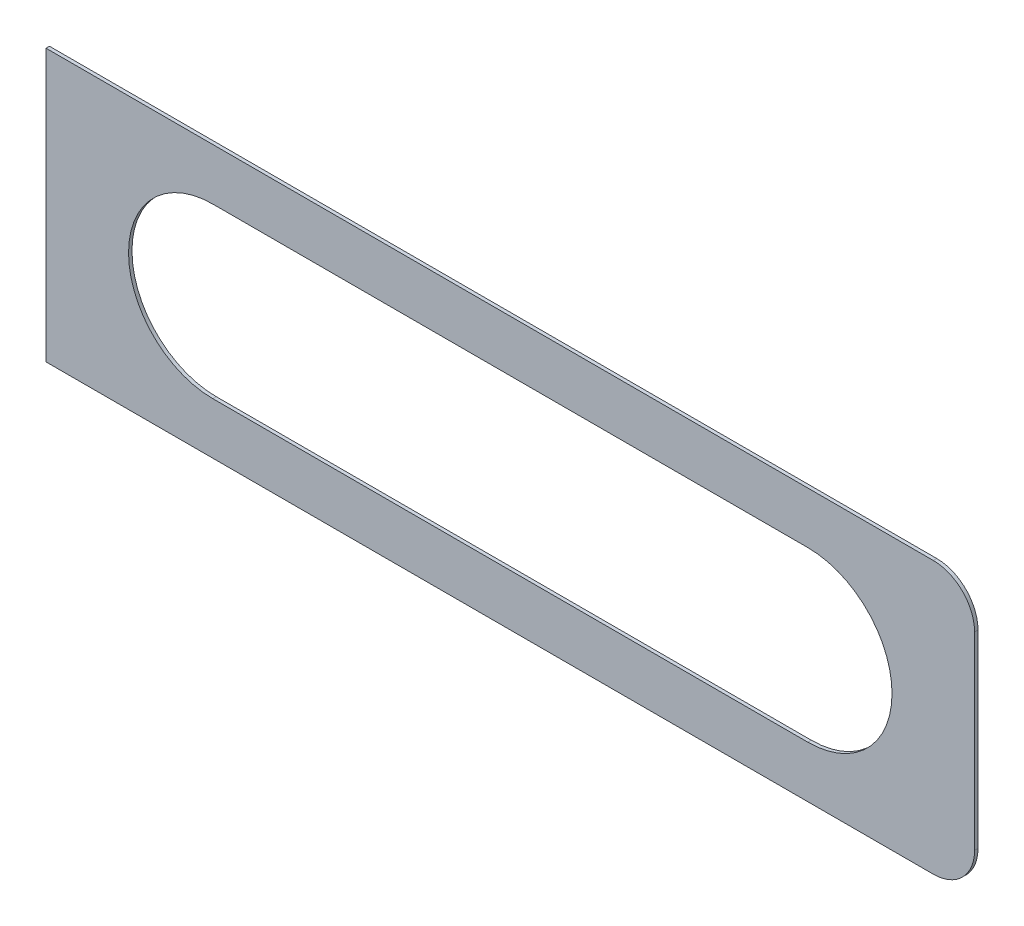
ISO-10303-21;
HEADER;
FILE_DESCRIPTION(('STEP AP214'),'2;1');
FILE_NAME('part.step','',(''),(''),'','','');
FILE_SCHEMA(('AUTOMOTIVE_DESIGN { 1 0 10303 214 1 1 1 1 }'));
ENDSEC;
DATA;
#1=APPLICATION_CONTEXT('core data for automotive mechanical design processes');
#2=APPLICATION_PROTOCOL_DEFINITION('international standard','automotive_design',2000,#1);
#3=PRODUCT_CONTEXT('',#1,'mechanical');
#4=PRODUCT('Part','Part','',(#3));
#5=PRODUCT_RELATED_PRODUCT_CATEGORY('part','',(#4));
#6=PRODUCT_DEFINITION_FORMATION('','',#4);
#7=PRODUCT_DEFINITION_CONTEXT('part definition',#1,'design');
#8=PRODUCT_DEFINITION('design','',#6,#7);
#9=PRODUCT_DEFINITION_SHAPE('','',#8);
#10=(LENGTH_UNIT() NAMED_UNIT(*) SI_UNIT(.MILLI.,.METRE.));
#11=(NAMED_UNIT(*) PLANE_ANGLE_UNIT() SI_UNIT($,.RADIAN.));
#12=(NAMED_UNIT(*) SI_UNIT($,.STERADIAN.) SOLID_ANGLE_UNIT());
#13=UNCERTAINTY_MEASURE_WITH_UNIT(LENGTH_MEASURE(1.E-05),#10,'distance_accuracy_value','');
#14=(GEOMETRIC_REPRESENTATION_CONTEXT(3) GLOBAL_UNCERTAINTY_ASSIGNED_CONTEXT((#13)) GLOBAL_UNIT_ASSIGNED_CONTEXT((#10,
#11,#12)) REPRESENTATION_CONTEXT('',''));
#15=CARTESIAN_POINT('',(0.,0.,0.));
#16=DIRECTION('',(0.,0.,1.));
#17=DIRECTION('',(1.,0.,0.));
#18=AXIS2_PLACEMENT_3D('',#15,#16,#17);
#19=CARTESIAN_POINT('',(-34.29,10.033,0.254));
#20=DIRECTION('',(1.,0.,0.));
#21=DIRECTION('',(0.,0.,-1.));
#22=AXIS2_PLACEMENT_3D('',#19,#20,#21);
#23=PLANE('',#22);
#24=DIRECTION('',(0.,-1.,0.));
#25=VECTOR('',#24,1.);
#26=CARTESIAN_POINT('',(-34.29,10.033,0.));
#27=LINE('',#26,#25);
#28=CARTESIAN_POINT('',(-34.29,10.033,0.));
#29=VERTEX_POINT('',#28);
#30=CARTESIAN_POINT('',(-34.29,-10.033,0.));
#31=VERTEX_POINT('',#30);
#32=EDGE_CURVE('E159',#29,#31,#27,.T.);
#33=ORIENTED_EDGE('',*,*,#32,.T.);
#34=DIRECTION('',(0.,0.,-1.));
#35=VECTOR('',#34,1.);
#36=CARTESIAN_POINT('',(-34.29,-10.033,0.254));
#37=LINE('',#36,#35);
#38=CARTESIAN_POINT('',(-34.29,-10.033,0.254));
#39=VERTEX_POINT('',#38);
#40=EDGE_CURVE('E13',#39,#31,#37,.T.);
#41=ORIENTED_EDGE('',*,*,#40,.F.);
#42=DIRECTION('',(0.,-1.,0.));
#43=VECTOR('',#42,1.);
#44=CARTESIAN_POINT('',(-34.29,10.033,0.254));
#45=LINE('',#44,#43);
#46=CARTESIAN_POINT('',(-34.29,10.033,0.254));
#47=VERTEX_POINT('',#46);
#48=EDGE_CURVE('E163',#47,#39,#45,.T.);
#49=ORIENTED_EDGE('',*,*,#48,.F.);
#50=DIRECTION('',(0.,0.,-1.));
#51=VECTOR('',#50,1.);
#52=CARTESIAN_POINT('',(-34.29,10.033,0.254));
#53=LINE('',#52,#51);
#54=EDGE_CURVE('E177',#47,#29,#53,.T.);
#55=ORIENTED_EDGE('',*,*,#54,.T.);
#56=EDGE_LOOP('',(#33,#41,#49,#55));
#57=FACE_BOUND('',#56,.T.);
#58=ADVANCED_FACE('F50',(#57),#23,.F.);
#59=CARTESIAN_POINT('',(-34.29,-10.033,0.254));
#60=DIRECTION('',(0.,1.,0.));
#61=DIRECTION('',(0.,0.,1.));
#62=AXIS2_PLACEMENT_3D('',#59,#60,#61);
#63=PLANE('',#62);
#64=DIRECTION('',(1.,0.,0.));
#65=VECTOR('',#64,1.);
#66=CARTESIAN_POINT('',(-34.29,-10.033,0.));
#67=LINE('',#66,#65);
#68=CARTESIAN_POINT('',(31.242,-10.033,0.));
#69=VERTEX_POINT('',#68);
#70=EDGE_CURVE('E180',#31,#69,#67,.T.);
#71=ORIENTED_EDGE('',*,*,#70,.T.);
#72=DIRECTION('',(0.,0.,-1.));
#73=VECTOR('',#72,1.);
#74=CARTESIAN_POINT('',(31.242,-10.033,0.254));
#75=LINE('',#74,#73);
#76=CARTESIAN_POINT('',(31.242,-10.033,0.254));
#77=VERTEX_POINT('',#76);
#78=EDGE_CURVE('E57',#77,#69,#75,.T.);
#79=ORIENTED_EDGE('',*,*,#78,.F.);
#80=DIRECTION('',(1.,0.,0.));
#81=VECTOR('',#80,1.);
#82=CARTESIAN_POINT('',(-34.29,-10.033,0.254));
#83=LINE('',#82,#81);
#84=EDGE_CURVE('E166',#39,#77,#83,.T.);
#85=ORIENTED_EDGE('',*,*,#84,.F.);
#86=ORIENTED_EDGE('',*,*,#40,.T.);
#87=EDGE_LOOP('',(#71,#79,#85,#86));
#88=FACE_BOUND('',#87,.T.);
#89=ADVANCED_FACE('F225',(#88),#63,.F.);
#90=CARTESIAN_POINT('',(31.242,-6.985,0.254));
#91=DIRECTION('',(0.,0.,-1.));
#92=DIRECTION('',(-1.,0.,0.));
#93=AXIS2_PLACEMENT_3D('',#90,#91,#92);
#94=CYLINDRICAL_SURFACE('',#93,3.048);
#95=CARTESIAN_POINT('',(31.242,-6.985,0.));
#96=DIRECTION('',(0.,0.,1.));
#97=DIRECTION('',(1.,0.,0.));
#98=AXIS2_PLACEMENT_3D('',#95,#96,#97);
#99=CIRCLE('',#98,3.048);
#100=CARTESIAN_POINT('',(34.29,-6.98499999999998,0.));
#101=VERTEX_POINT('',#100);
#102=EDGE_CURVE('E182',#69,#101,#99,.T.);
#103=ORIENTED_EDGE('',*,*,#102,.T.);
#104=DIRECTION('',(0.,0.,-1.));
#105=VECTOR('',#104,1.);
#106=CARTESIAN_POINT('',(34.29,-6.98499999999998,0.254));
#107=LINE('',#106,#105);
#108=CARTESIAN_POINT('',(34.29,-6.98499999999998,0.254));
#109=VERTEX_POINT('',#108);
#110=EDGE_CURVE('E197',#109,#101,#107,.T.);
#111=ORIENTED_EDGE('',*,*,#110,.F.);
#112=CARTESIAN_POINT('',(31.242,-6.985,0.254));
#113=DIRECTION('',(0.,0.,1.));
#114=DIRECTION('',(1.,0.,0.));
#115=AXIS2_PLACEMENT_3D('',#112,#113,#114);
#116=CIRCLE('',#115,3.048);
#117=EDGE_CURVE('E169',#77,#109,#116,.T.);
#118=ORIENTED_EDGE('',*,*,#117,.F.);
#119=ORIENTED_EDGE('',*,*,#78,.T.);
#120=EDGE_LOOP('',(#103,#111,#118,#119));
#121=FACE_BOUND('',#120,.T.);
#122=ADVANCED_FACE('F204',(#121),#94,.T.);
#123=CARTESIAN_POINT('',(34.29,6.98499999999998,0.254));
#124=DIRECTION('',(-1.,0.,0.));
#125=DIRECTION('',(0.,-1.,0.));
#126=AXIS2_PLACEMENT_3D('',#123,#124,#125);
#127=PLANE('',#126);
#128=DIRECTION('',(0.,1.,0.));
#129=VECTOR('',#128,1.);
#130=CARTESIAN_POINT('',(34.29,6.98499999999998,0.));
#131=LINE('',#130,#129);
#132=CARTESIAN_POINT('',(34.29,6.98499999999998,0.));
#133=VERTEX_POINT('',#132);
#134=EDGE_CURVE('E184',#101,#133,#131,.T.);
#135=ORIENTED_EDGE('',*,*,#134,.T.);
#136=DIRECTION('',(0.,0.,-1.));
#137=VECTOR('',#136,1.);
#138=CARTESIAN_POINT('',(34.29,6.98499999999998,0.254));
#139=LINE('',#138,#137);
#140=CARTESIAN_POINT('',(34.29,6.98499999999998,0.254));
#141=VERTEX_POINT('',#140);
#142=EDGE_CURVE('E194',#141,#133,#139,.T.);
#143=ORIENTED_EDGE('',*,*,#142,.F.);
#144=DIRECTION('',(0.,1.,0.));
#145=VECTOR('',#144,1.);
#146=CARTESIAN_POINT('',(34.29,6.98499999999998,0.254));
#147=LINE('',#146,#145);
#148=EDGE_CURVE('E171',#109,#141,#147,.T.);
#149=ORIENTED_EDGE('',*,*,#148,.F.);
#150=ORIENTED_EDGE('',*,*,#110,.T.);
#151=EDGE_LOOP('',(#135,#143,#149,#150));
#152=FACE_BOUND('',#151,.T.);
#153=ADVANCED_FACE('F213',(#152),#127,.F.);
#154=CARTESIAN_POINT('',(31.242,6.985,0.254));
#155=DIRECTION('',(0.,0.,-1.));
#156=DIRECTION('',(-1.,0.,0.));
#157=AXIS2_PLACEMENT_3D('',#154,#155,#156);
#158=CYLINDRICAL_SURFACE('',#157,3.048);
#159=CARTESIAN_POINT('',(31.242,6.985,0.));
#160=DIRECTION('',(0.,0.,1.));
#161=DIRECTION('',(1.,0.,0.));
#162=AXIS2_PLACEMENT_3D('',#159,#160,#161);
#163=CIRCLE('',#162,3.048);
#164=CARTESIAN_POINT('',(31.242,10.033,0.));
#165=VERTEX_POINT('',#164);
#166=EDGE_CURVE('E186',#133,#165,#163,.T.);
#167=ORIENTED_EDGE('',*,*,#166,.T.);
#168=DIRECTION('',(0.,0.,-1.));
#169=VECTOR('',#168,1.);
#170=CARTESIAN_POINT('',(31.242,10.033,0.254));
#171=LINE('',#170,#169);
#172=CARTESIAN_POINT('',(31.242,10.033,0.254));
#173=VERTEX_POINT('',#172);
#174=EDGE_CURVE('E191',#173,#165,#171,.T.);
#175=ORIENTED_EDGE('',*,*,#174,.F.);
#176=CARTESIAN_POINT('',(31.242,6.985,0.254));
#177=DIRECTION('',(0.,0.,1.));
#178=DIRECTION('',(1.,0.,0.));
#179=AXIS2_PLACEMENT_3D('',#176,#177,#178);
#180=CIRCLE('',#179,3.048);
#181=EDGE_CURVE('E173',#141,#173,#180,.T.);
#182=ORIENTED_EDGE('',*,*,#181,.F.);
#183=ORIENTED_EDGE('',*,*,#142,.T.);
#184=EDGE_LOOP('',(#167,#175,#182,#183));
#185=FACE_BOUND('',#184,.T.);
#186=ADVANCED_FACE('F217',(#185),#158,.T.);
#187=CARTESIAN_POINT('',(-34.29,10.033,0.254));
#188=DIRECTION('',(0.,-1.,0.));
#189=DIRECTION('',(0.,0.,-1.));
#190=AXIS2_PLACEMENT_3D('',#187,#188,#189);
#191=PLANE('',#190);
#192=DIRECTION('',(-1.,0.,0.));
#193=VECTOR('',#192,1.);
#194=CARTESIAN_POINT('',(-34.29,10.033,0.));
#195=LINE('',#194,#193);
#196=EDGE_CURVE('E167',#165,#29,#195,.T.);
#197=ORIENTED_EDGE('',*,*,#196,.T.);
#198=ORIENTED_EDGE('',*,*,#54,.F.);
#199=DIRECTION('',(-1.,0.,0.));
#200=VECTOR('',#199,1.);
#201=CARTESIAN_POINT('',(-34.29,10.033,0.254));
#202=LINE('',#201,#200);
#203=EDGE_CURVE('E175',#173,#47,#202,.T.);
#204=ORIENTED_EDGE('',*,*,#203,.F.);
#205=ORIENTED_EDGE('',*,*,#174,.T.);
#206=EDGE_LOOP('',(#197,#198,#204,#205));
#207=FACE_BOUND('',#206,.T.);
#208=ADVANCED_FACE('F228',(#207),#191,.F.);
#209=CARTESIAN_POINT('',(31.242,-6.985,0.254));
#210=DIRECTION('',(0.,0.,1.));
#211=DIRECTION('',(1.,0.,0.));
#212=AXIS2_PLACEMENT_3D('',#209,#210,#211);
#213=PLANE('',#212);
#214=CARTESIAN_POINT('',(-21.971,0.,0.254));
#215=DIRECTION('',(0.,0.,1.));
#216=DIRECTION('',(1.,0.,0.));
#217=AXIS2_PLACEMENT_3D('',#214,#215,#216);
#218=CIRCLE('',#217,6.223);
#219=CARTESIAN_POINT('',(-21.971,6.223,0.254));
#220=VERTEX_POINT('',#219);
#221=CARTESIAN_POINT('',(-21.971,-6.223,0.254));
#222=VERTEX_POINT('',#221);
#223=EDGE_CURVE('E64',#220,#222,#218,.T.);
#224=ORIENTED_EDGE('',*,*,#223,.F.);
#225=DIRECTION('',(-1.,0.,0.));
#226=VECTOR('',#225,1.);
#227=CARTESIAN_POINT('',(-21.971,6.223,0.254));
#228=LINE('',#227,#226);
#229=CARTESIAN_POINT('',(21.971,6.223,0.254));
#230=VERTEX_POINT('',#229);
#231=EDGE_CURVE('E144',#230,#220,#228,.T.);
#232=ORIENTED_EDGE('',*,*,#231,.F.);
#233=CARTESIAN_POINT('',(21.971,0.,0.254));
#234=DIRECTION('',(0.,0.,1.));
#235=DIRECTION('',(1.,0.,0.));
#236=AXIS2_PLACEMENT_3D('',#233,#234,#235);
#237=CIRCLE('',#236,6.223);
#238=CARTESIAN_POINT('',(21.971,-6.223,0.254));
#239=VERTEX_POINT('',#238);
#240=EDGE_CURVE('E147',#239,#230,#237,.T.);
#241=ORIENTED_EDGE('',*,*,#240,.F.);
#242=DIRECTION('',(1.,0.,0.));
#243=VECTOR('',#242,1.);
#244=CARTESIAN_POINT('',(-21.971,-6.223,0.254));
#245=LINE('',#244,#243);
#246=EDGE_CURVE('E153',#222,#239,#245,.T.);
#247=ORIENTED_EDGE('',*,*,#246,.F.);
#248=EDGE_LOOP('',(#224,#232,#241,#247));
#249=FACE_BOUND('',#248,.T.);
#250=ORIENTED_EDGE('',*,*,#48,.T.);
#251=ORIENTED_EDGE('',*,*,#84,.T.);
#252=ORIENTED_EDGE('',*,*,#117,.T.);
#253=ORIENTED_EDGE('',*,*,#148,.T.);
#254=ORIENTED_EDGE('',*,*,#181,.T.);
#255=ORIENTED_EDGE('',*,*,#203,.T.);
#256=EDGE_LOOP('',(#250,#251,#252,#253,#254,#255));
#257=FACE_BOUND('',#256,.T.);
#258=ADVANCED_FACE('F221',(#249,#257),#213,.T.);
#259=CARTESIAN_POINT('',(31.242,-6.985,0.));
#260=DIRECTION('',(0.,0.,1.));
#261=DIRECTION('',(1.,0.,0.));
#262=AXIS2_PLACEMENT_3D('',#259,#260,#261);
#263=PLANE('',#262);
#264=DIRECTION('',(-1.,0.,0.));
#265=VECTOR('',#264,1.);
#266=CARTESIAN_POINT('',(-21.971,6.223,0.));
#267=LINE('',#266,#265);
#268=CARTESIAN_POINT('',(21.971,6.223,0.));
#269=VERTEX_POINT('',#268);
#270=CARTESIAN_POINT('',(-21.971,6.223,0.));
#271=VERTEX_POINT('',#270);
#272=EDGE_CURVE('E134',#269,#271,#267,.T.);
#273=ORIENTED_EDGE('',*,*,#272,.T.);
#274=CARTESIAN_POINT('',(-21.971,0.,0.));
#275=DIRECTION('',(0.,0.,1.));
#276=DIRECTION('',(1.,0.,0.));
#277=AXIS2_PLACEMENT_3D('',#274,#275,#276);
#278=CIRCLE('',#277,6.223);
#279=CARTESIAN_POINT('',(-21.971,-6.223,0.));
#280=VERTEX_POINT('',#279);
#281=EDGE_CURVE('E128',#271,#280,#278,.T.);
#282=ORIENTED_EDGE('',*,*,#281,.T.);
#283=DIRECTION('',(1.,0.,0.));
#284=VECTOR('',#283,1.);
#285=CARTESIAN_POINT('',(-21.971,-6.223,0.));
#286=LINE('',#285,#284);
#287=CARTESIAN_POINT('',(21.971,-6.223,0.));
#288=VERTEX_POINT('',#287);
#289=EDGE_CURVE('E137',#280,#288,#286,.T.);
#290=ORIENTED_EDGE('',*,*,#289,.T.);
#291=CARTESIAN_POINT('',(21.971,0.,0.));
#292=DIRECTION('',(0.,0.,1.));
#293=DIRECTION('',(1.,0.,0.));
#294=AXIS2_PLACEMENT_3D('',#291,#292,#293);
#295=CIRCLE('',#294,6.223);
#296=EDGE_CURVE('E72',#288,#269,#295,.T.);
#297=ORIENTED_EDGE('',*,*,#296,.T.);
#298=EDGE_LOOP('',(#273,#282,#290,#297));
#299=FACE_BOUND('',#298,.T.);
#300=ORIENTED_EDGE('',*,*,#32,.F.);
#301=ORIENTED_EDGE('',*,*,#196,.F.);
#302=ORIENTED_EDGE('',*,*,#166,.F.);
#303=ORIENTED_EDGE('',*,*,#134,.F.);
#304=ORIENTED_EDGE('',*,*,#102,.F.);
#305=ORIENTED_EDGE('',*,*,#70,.F.);
#306=EDGE_LOOP('',(#300,#301,#302,#303,#304,#305));
#307=FACE_BOUND('',#306,.T.);
#308=ADVANCED_FACE('F141',(#299,#307),#263,.F.);
#309=CARTESIAN_POINT('',(-21.971,0.,0.));
#310=DIRECTION('',(0.,0.,1.));
#311=DIRECTION('',(1.,0.,0.));
#312=AXIS2_PLACEMENT_3D('',#309,#310,#311);
#313=CYLINDRICAL_SURFACE('',#312,6.223);
#314=ORIENTED_EDGE('',*,*,#223,.T.);
#315=DIRECTION('',(0.,0.,1.));
#316=VECTOR('',#315,1.);
#317=CARTESIAN_POINT('',(-21.971,-6.223,0.));
#318=LINE('',#317,#316);
#319=EDGE_CURVE('E124',#280,#222,#318,.T.);
#320=ORIENTED_EDGE('',*,*,#319,.F.);
#321=ORIENTED_EDGE('',*,*,#281,.F.);
#322=DIRECTION('',(0.,0.,1.));
#323=VECTOR('',#322,1.);
#324=CARTESIAN_POINT('',(-21.971,6.223,0.));
#325=LINE('',#324,#323);
#326=EDGE_CURVE('E157',#271,#220,#325,.T.);
#327=ORIENTED_EDGE('',*,*,#326,.T.);
#328=EDGE_LOOP('',(#314,#320,#321,#327));
#329=FACE_BOUND('',#328,.T.);
#330=ADVANCED_FACE('F126',(#329),#313,.F.);
#331=CARTESIAN_POINT('',(-21.971,6.223,0.));
#332=DIRECTION('',(0.,1.,0.));
#333=DIRECTION('',(0.,0.,1.));
#334=AXIS2_PLACEMENT_3D('',#331,#332,#333);
#335=PLANE('',#334);
#336=ORIENTED_EDGE('',*,*,#231,.T.);
#337=ORIENTED_EDGE('',*,*,#326,.F.);
#338=ORIENTED_EDGE('',*,*,#272,.F.);
#339=DIRECTION('',(0.,0.,1.));
#340=VECTOR('',#339,1.);
#341=CARTESIAN_POINT('',(21.971,6.223,0.));
#342=LINE('',#341,#340);
#343=EDGE_CURVE('E160',#269,#230,#342,.T.);
#344=ORIENTED_EDGE('',*,*,#343,.T.);
#345=EDGE_LOOP('',(#336,#337,#338,#344));
#346=FACE_BOUND('',#345,.T.);
#347=ADVANCED_FACE('F287',(#346),#335,.F.);
#348=CARTESIAN_POINT('',(21.971,0.,0.));
#349=DIRECTION('',(0.,0.,1.));
#350=DIRECTION('',(1.,0.,0.));
#351=AXIS2_PLACEMENT_3D('',#348,#349,#350);
#352=CYLINDRICAL_SURFACE('',#351,6.223);
#353=ORIENTED_EDGE('',*,*,#240,.T.);
#354=ORIENTED_EDGE('',*,*,#343,.F.);
#355=ORIENTED_EDGE('',*,*,#296,.F.);
#356=DIRECTION('',(0.,0.,1.));
#357=VECTOR('',#356,1.);
#358=CARTESIAN_POINT('',(21.971,-6.223,0.));
#359=LINE('',#358,#357);
#360=EDGE_CURVE('E133',#288,#239,#359,.T.);
#361=ORIENTED_EDGE('',*,*,#360,.T.);
#362=EDGE_LOOP('',(#353,#354,#355,#361));
#363=FACE_BOUND('',#362,.T.);
#364=ADVANCED_FACE('F297',(#363),#352,.F.);
#365=CARTESIAN_POINT('',(-21.971,-6.223,0.));
#366=DIRECTION('',(0.,-1.,0.));
#367=DIRECTION('',(0.,0.,-1.));
#368=AXIS2_PLACEMENT_3D('',#365,#366,#367);
#369=PLANE('',#368);
#370=ORIENTED_EDGE('',*,*,#246,.T.);
#371=ORIENTED_EDGE('',*,*,#360,.F.);
#372=ORIENTED_EDGE('',*,*,#289,.F.);
#373=ORIENTED_EDGE('',*,*,#319,.T.);
#374=EDGE_LOOP('',(#370,#371,#372,#373));
#375=FACE_BOUND('',#374,.T.);
#376=ADVANCED_FACE('F138',(#375),#369,.F.);
#377=CLOSED_SHELL('',(#58,#89,#122,#153,#186,#208,#258,#308,#330,#347,#364,#376));
#378=MANIFOLD_SOLID_BREP('B2',#377);
#379=ADVANCED_BREP_SHAPE_REPRESENTATION('',(#18,#378),#14);
#380=SHAPE_DEFINITION_REPRESENTATION(#9,#379);
ENDSEC;
END-ISO-10303-21;
